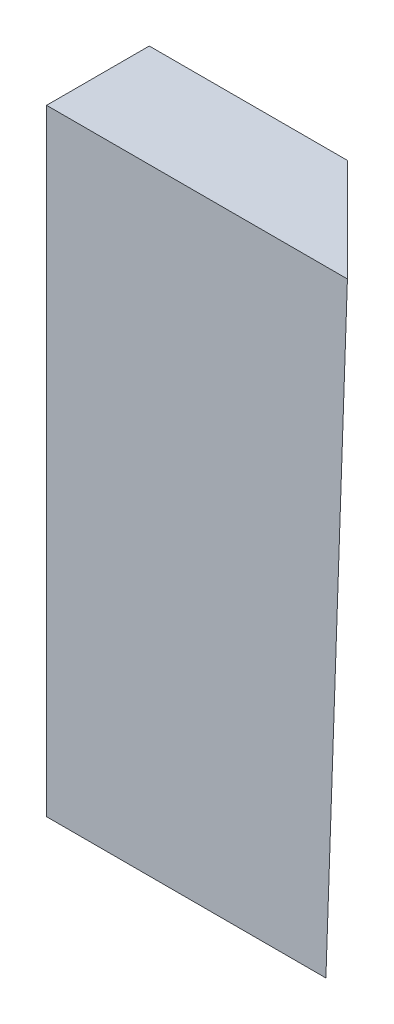
ISO-10303-21;
HEADER;
FILE_DESCRIPTION(('STEP AP214'),'2;1');
FILE_NAME('part.step','',(''),(''),'','','');
FILE_SCHEMA(('AUTOMOTIVE_DESIGN { 1 0 10303 214 1 1 1 1 }'));
ENDSEC;
DATA;
#1=APPLICATION_CONTEXT('core data for automotive mechanical design processes');
#2=APPLICATION_PROTOCOL_DEFINITION('international standard','automotive_design',2000,#1);
#3=PRODUCT_CONTEXT('',#1,'mechanical');
#4=PRODUCT('Part','Part','',(#3));
#5=PRODUCT_RELATED_PRODUCT_CATEGORY('part','',(#4));
#6=PRODUCT_DEFINITION_FORMATION('','',#4);
#7=PRODUCT_DEFINITION_CONTEXT('part definition',#1,'design');
#8=PRODUCT_DEFINITION('design','',#6,#7);
#9=PRODUCT_DEFINITION_SHAPE('','',#8);
#10=(LENGTH_UNIT() NAMED_UNIT(*) SI_UNIT(.MILLI.,.METRE.));
#11=(NAMED_UNIT(*) PLANE_ANGLE_UNIT() SI_UNIT($,.RADIAN.));
#12=(NAMED_UNIT(*) SI_UNIT($,.STERADIAN.) SOLID_ANGLE_UNIT());
#13=UNCERTAINTY_MEASURE_WITH_UNIT(LENGTH_MEASURE(1.E-05),#10,'distance_accuracy_value','');
#14=(GEOMETRIC_REPRESENTATION_CONTEXT(3) GLOBAL_UNCERTAINTY_ASSIGNED_CONTEXT((#13)) GLOBAL_UNIT_ASSIGNED_CONTEXT((#10,
#11,#12)) REPRESENTATION_CONTEXT('',''));
#15=CARTESIAN_POINT('',(0.,0.,0.));
#16=DIRECTION('',(0.,0.,1.));
#17=DIRECTION('',(1.,0.,0.));
#18=AXIS2_PLACEMENT_3D('',#15,#16,#17);
#19=CARTESIAN_POINT('',(0.,0.,0.));
#20=DIRECTION('',(0.,1.,0.));
#21=DIRECTION('',(0.,0.,1.));
#22=AXIS2_PLACEMENT_3D('',#19,#20,#21);
#23=PLANE('',#22);
#24=DIRECTION('',(0.,0.,1.));
#25=VECTOR('',#24,1.);
#26=CARTESIAN_POINT('',(0.,0.,-12.5));
#27=LINE('',#26,#25);
#28=CARTESIAN_POINT('',(0.,0.,-12.5));
#29=VERTEX_POINT('',#28);
#30=CARTESIAN_POINT('',(0.,0.,0.));
#31=VERTEX_POINT('',#30);
#32=EDGE_CURVE('E240',#29,#31,#27,.T.);
#33=ORIENTED_EDGE('',*,*,#32,.F.);
#34=DIRECTION('',(-1.,0.,0.));
#35=VECTOR('',#34,1.);
#36=CARTESIAN_POINT('',(21.5,0.,-12.5));
#37=LINE('',#36,#35);
#38=CARTESIAN_POINT('',(21.5,0.,-12.5));
#39=VERTEX_POINT('',#38);
#40=EDGE_CURVE('E12',#39,#29,#37,.T.);
#41=ORIENTED_EDGE('',*,*,#40,.F.);
#42=DIRECTION('',(-0.707106781186548,0.,-0.707106781186547));
#43=VECTOR('',#42,1.);
#44=CARTESIAN_POINT('',(34.,0.,0.));
#45=LINE('',#44,#43);
#46=CARTESIAN_POINT('',(34.,0.,0.));
#47=VERTEX_POINT('',#46);
#48=EDGE_CURVE('E61',#47,#39,#45,.T.);
#49=ORIENTED_EDGE('',*,*,#48,.F.);
#50=DIRECTION('',(1.,0.,0.));
#51=VECTOR('',#50,1.);
#52=CARTESIAN_POINT('',(0.,0.,0.));
#53=LINE('',#52,#51);
#54=EDGE_CURVE('E105',#31,#47,#53,.T.);
#55=ORIENTED_EDGE('',*,*,#54,.F.);
#56=EDGE_LOOP('',(#33,#41,#49,#55));
#57=FACE_BOUND('',#56,.T.);
#58=ADVANCED_FACE('F51',(#57),#23,.F.);
#59=CARTESIAN_POINT('',(5.11606049714624E-13,75.,0.));
#60=DIRECTION('',(0.,-1.,0.));
#61=DIRECTION('',(1.,0.,0.));
#62=AXIS2_PLACEMENT_3D('',#59,#60,#61);
#63=PLANE('',#62);
#64=DIRECTION('',(-1.,0.,0.));
#65=VECTOR('',#64,1.);
#66=CARTESIAN_POINT('',(36.6200000000005,74.9999999999997,0.));
#67=LINE('',#66,#65);
#68=CARTESIAN_POINT('',(36.6200000000005,74.9999999999997,0.));
#69=VERTEX_POINT('',#68);
#70=CARTESIAN_POINT('',(5.2372220082647E-13,75.,0.));
#71=VERTEX_POINT('',#70);
#72=EDGE_CURVE('E102',#69,#71,#67,.T.);
#73=ORIENTED_EDGE('',*,*,#72,.F.);
#74=DIRECTION('',(0.707106781186562,0.,0.707106781186533));
#75=VECTOR('',#74,1.);
#76=CARTESIAN_POINT('',(36.6200000000005,74.9999999999997,0.));
#77=LINE('',#76,#75);
#78=CARTESIAN_POINT('',(24.12,74.9999999999998,-12.5));
#79=VERTEX_POINT('',#78);
#80=EDGE_CURVE('E111',#79,#69,#77,.T.);
#81=ORIENTED_EDGE('',*,*,#80,.F.);
#82=DIRECTION('',(1.,0.,0.));
#83=VECTOR('',#82,1.);
#84=CARTESIAN_POINT('',(0.,75.,-12.5));
#85=LINE('',#84,#83);
#86=CARTESIAN_POINT('',(0.,75.,-12.5));
#87=VERTEX_POINT('',#86);
#88=EDGE_CURVE('E119',#87,#79,#85,.T.);
#89=ORIENTED_EDGE('',*,*,#88,.F.);
#90=DIRECTION('',(0.,0.,-1.));
#91=VECTOR('',#90,1.);
#92=CARTESIAN_POINT('',(5.2372220082647E-13,75.,0.));
#93=LINE('',#92,#91);
#94=EDGE_CURVE('E124',#71,#87,#93,.T.);
#95=ORIENTED_EDGE('',*,*,#94,.F.);
#96=EDGE_LOOP('',(#73,#81,#89,#95));
#97=FACE_BOUND('',#96,.T.);
#98=ADVANCED_FACE('F123',(#97),#63,.F.);
#99=CARTESIAN_POINT('',(0.,0.,0.));
#100=DIRECTION('',(0.,0.,1.));
#101=DIRECTION('',(1.,0.,0.));
#102=AXIS2_PLACEMENT_3D('',#99,#100,#101);
#103=PLANE('',#102);
#104=DIRECTION('',(0.,-1.,0.));
#105=VECTOR('',#104,1.);
#106=CARTESIAN_POINT('',(5.2372220082647E-13,75.,0.));
#107=LINE('',#106,#105);
#108=EDGE_CURVE('E108',#71,#31,#107,.T.);
#109=ORIENTED_EDGE('',*,*,#108,.T.);
#110=ORIENTED_EDGE('',*,*,#54,.T.);
#111=DIRECTION('',(-0.0349120375891751,-0.999390389002902,0.));
#112=VECTOR('',#111,1.);
#113=CARTESIAN_POINT('',(36.6200000000005,74.9999999999997,0.));
#114=LINE('',#113,#112);
#115=EDGE_CURVE('E97',#69,#47,#114,.T.);
#116=ORIENTED_EDGE('',*,*,#115,.F.);
#117=ORIENTED_EDGE('',*,*,#72,.T.);
#118=EDGE_LOOP('',(#109,#110,#116,#117));
#119=FACE_BOUND('',#118,.T.);
#120=ADVANCED_FACE('F100',(#119),#103,.T.);
#121=CARTESIAN_POINT('',(16.9896334542326,-0.593504528667978,-16.9896334542326));
#122=DIRECTION('',(0.706891152579431,-0.0246940642634464,-0.706891152579431));
#123=DIRECTION('',(-0.707106781186548,0.,-0.707106781186547));
#124=AXIS2_PLACEMENT_3D('',#121,#122,#123);
#125=PLANE('',#124);
#126=ORIENTED_EDGE('',*,*,#115,.T.);
#127=ORIENTED_EDGE('',*,*,#48,.T.);
#128=DIRECTION('',(-0.0349120375891682,-0.999390389002902,0.));
#129=VECTOR('',#128,1.);
#130=CARTESIAN_POINT('',(24.12,74.9999999999998,-12.5));
#131=LINE('',#130,#129);
#132=EDGE_CURVE('E115',#79,#39,#131,.T.);
#133=ORIENTED_EDGE('',*,*,#132,.F.);
#134=ORIENTED_EDGE('',*,*,#80,.T.);
#135=EDGE_LOOP('',(#126,#127,#133,#134));
#136=FACE_BOUND('',#135,.T.);
#137=ADVANCED_FACE('F113',(#136),#125,.T.);
#138=CARTESIAN_POINT('',(0.,0.,0.));
#139=DIRECTION('',(-1.,0.,0.));
#140=DIRECTION('',(0.,0.,1.));
#141=AXIS2_PLACEMENT_3D('',#138,#139,#140);
#142=PLANE('',#141);
#143=DIRECTION('',(0.,-1.,0.));
#144=VECTOR('',#143,1.);
#145=CARTESIAN_POINT('',(0.,75.,-12.5));
#146=LINE('',#145,#144);
#147=EDGE_CURVE('E69',#87,#29,#146,.T.);
#148=ORIENTED_EDGE('',*,*,#147,.T.);
#149=ORIENTED_EDGE('',*,*,#32,.T.);
#150=ORIENTED_EDGE('',*,*,#108,.F.);
#151=ORIENTED_EDGE('',*,*,#94,.T.);
#152=EDGE_LOOP('',(#148,#149,#150,#151));
#153=FACE_BOUND('',#152,.T.);
#154=ADVANCED_FACE('F178',(#153),#142,.T.);
#155=CARTESIAN_POINT('',(0.,0.,-12.5));
#156=DIRECTION('',(0.,0.,-1.));
#157=DIRECTION('',(-1.,0.,0.));
#158=AXIS2_PLACEMENT_3D('',#155,#156,#157);
#159=PLANE('',#158);
#160=ORIENTED_EDGE('',*,*,#132,.T.);
#161=ORIENTED_EDGE('',*,*,#40,.T.);
#162=ORIENTED_EDGE('',*,*,#147,.F.);
#163=ORIENTED_EDGE('',*,*,#88,.T.);
#164=EDGE_LOOP('',(#160,#161,#162,#163));
#165=FACE_BOUND('',#164,.T.);
#166=ADVANCED_FACE('F186',(#165),#159,.T.);
#167=CLOSED_SHELL('',(#58,#98,#120,#137,#154,#166));
#168=MANIFOLD_SOLID_BREP('B2',#167);
#169=ADVANCED_BREP_SHAPE_REPRESENTATION('',(#18,#168),#14);
#170=SHAPE_DEFINITION_REPRESENTATION(#9,#169);
ENDSEC;
END-ISO-10303-21;
